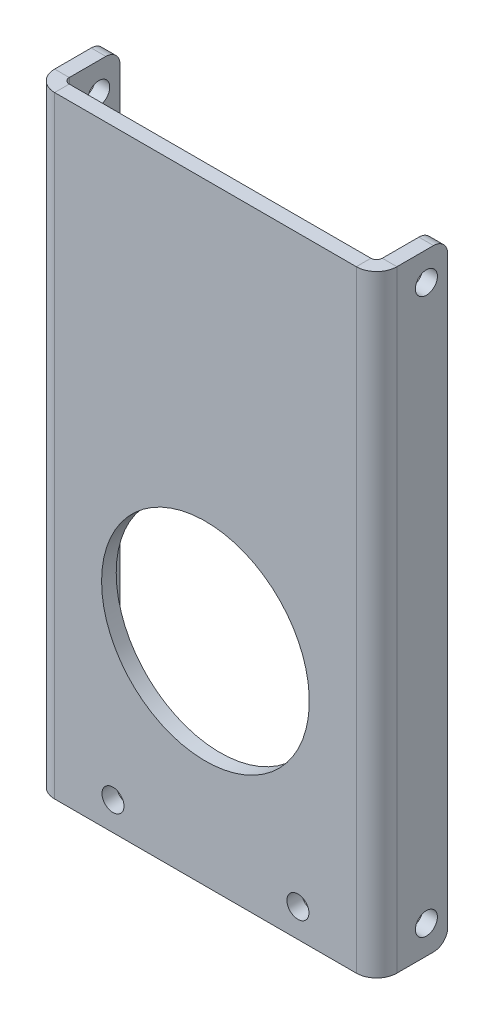
ISO-10303-21;
HEADER;
FILE_DESCRIPTION(('STEP AP214'),'2;1');
FILE_NAME('part.step','',(''),(''),'','','');
FILE_SCHEMA(('AUTOMOTIVE_DESIGN { 1 0 10303 214 1 1 1 1 }'));
ENDSEC;
DATA;
#1=APPLICATION_CONTEXT('core data for automotive mechanical design processes');
#2=APPLICATION_PROTOCOL_DEFINITION('international standard','automotive_design',2000,#1);
#3=PRODUCT_CONTEXT('',#1,'mechanical');
#4=PRODUCT('Part','Part','',(#3));
#5=PRODUCT_RELATED_PRODUCT_CATEGORY('part','',(#4));
#6=PRODUCT_DEFINITION_FORMATION('','',#4);
#7=PRODUCT_DEFINITION_CONTEXT('part definition',#1,'design');
#8=PRODUCT_DEFINITION('design','',#6,#7);
#9=PRODUCT_DEFINITION_SHAPE('','',#8);
#10=(LENGTH_UNIT() NAMED_UNIT(*) SI_UNIT(.MILLI.,.METRE.));
#11=(NAMED_UNIT(*) PLANE_ANGLE_UNIT() SI_UNIT($,.RADIAN.));
#12=(NAMED_UNIT(*) SI_UNIT($,.STERADIAN.) SOLID_ANGLE_UNIT());
#13=UNCERTAINTY_MEASURE_WITH_UNIT(LENGTH_MEASURE(1.E-05),#10,'distance_accuracy_value','');
#14=(GEOMETRIC_REPRESENTATION_CONTEXT(3) GLOBAL_UNCERTAINTY_ASSIGNED_CONTEXT((#13)) GLOBAL_UNIT_ASSIGNED_CONTEXT((#10,
#11,#12)) REPRESENTATION_CONTEXT('',''));
#15=CARTESIAN_POINT('',(0.,0.,0.));
#16=DIRECTION('',(0.,0.,1.));
#17=DIRECTION('',(1.,0.,0.));
#18=AXIS2_PLACEMENT_3D('',#15,#16,#17);
#19=CARTESIAN_POINT('',(0.,0.,-3.26389999999999));
#20=DIRECTION('',(0.,0.,1.));
#21=DIRECTION('',(1.,0.,0.));
#22=AXIS2_PLACEMENT_3D('',#19,#20,#21);
#23=PLANE('',#22);
#24=CARTESIAN_POINT('',(-20.6375,-40.978582,-3.26389999999999));
#25=DIRECTION('',(0.,0.,1.));
#26=DIRECTION('',(1.,0.,0.));
#27=AXIS2_PLACEMENT_3D('',#24,#25,#26);
#28=CIRCLE('',#27,2.45744999999999);
#29=CARTESIAN_POINT('',(-18.18005,-40.978582,-3.26389999999999));
#30=VERTEX_POINT('',#29);
#31=EDGE_CURVE('E526',#30,#30,#28,.T.);
#32=ORIENTED_EDGE('',*,*,#31,.T.);
#33=EDGE_LOOP('',(#32));
#34=FACE_BOUND('',#33,.T.);
#35=CARTESIAN_POINT('',(20.6375,-40.978582,-3.26389999999999));
#36=DIRECTION('',(0.,0.,1.));
#37=DIRECTION('',(1.,0.,0.));
#38=AXIS2_PLACEMENT_3D('',#35,#36,#37);
#39=CIRCLE('',#38,2.45744999999999);
#40=CARTESIAN_POINT('',(23.09495,-40.978582,-3.26389999999999));
#41=VERTEX_POINT('',#40);
#42=EDGE_CURVE('E536',#41,#41,#39,.T.);
#43=ORIENTED_EDGE('',*,*,#42,.T.);
#44=EDGE_LOOP('',(#43));
#45=FACE_BOUND('',#44,.T.);
#46=CARTESIAN_POINT('',(0.,0.,-3.26389999999999));
#47=DIRECTION('',(0.,0.,-1.));
#48=DIRECTION('',(-1.,0.,0.));
#49=AXIS2_PLACEMENT_3D('',#46,#47,#48);
#50=CIRCLE('',#49,23.1775);
#51=CARTESIAN_POINT('',(-23.1775,0.,-3.26389999999999));
#52=VERTEX_POINT('',#51);
#53=EDGE_CURVE('E539',#52,#52,#50,.T.);
#54=ORIENTED_EDGE('',*,*,#53,.F.);
#55=EDGE_LOOP('',(#54));
#56=FACE_BOUND('',#55,.T.);
#57=DIRECTION('',(0.,1.,0.));
#58=VECTOR('',#57,1.);
#59=CARTESIAN_POINT('',(-33.655,89.196418,-3.26389999999999));
#60=LINE('',#59,#58);
#61=CARTESIAN_POINT('',(-33.655,89.196418,-3.26389999999999));
#62=VERTEX_POINT('',#61);
#63=CARTESIAN_POINT('',(-33.655,-47.328582,-3.26389999999999));
#64=VERTEX_POINT('',#63);
#65=EDGE_CURVE('E264',#62,#64,#60,.F.);
#66=ORIENTED_EDGE('',*,*,#65,.F.);
#67=DIRECTION('',(-1.,0.,0.));
#68=VECTOR('',#67,1.);
#69=CARTESIAN_POINT('',(-38.1889,89.196418,-3.26389999999999));
#70=LINE('',#69,#68);
#71=CARTESIAN_POINT('',(33.655,89.196418,-3.26389999999999));
#72=VERTEX_POINT('',#71);
#73=EDGE_CURVE('E325',#72,#62,#70,.T.);
#74=ORIENTED_EDGE('',*,*,#73,.F.);
#75=DIRECTION('',(0.,-1.,0.));
#76=VECTOR('',#75,1.);
#77=CARTESIAN_POINT('',(33.655,-47.328582,-3.26390000000001));
#78=LINE('',#77,#76);
#79=CARTESIAN_POINT('',(33.655,-47.3285819999999,-3.26390000000001));
#80=VERTEX_POINT('',#79);
#81=EDGE_CURVE('E312',#80,#72,#78,.F.);
#82=ORIENTED_EDGE('',*,*,#81,.F.);
#83=DIRECTION('',(1.,0.,0.));
#84=VECTOR('',#83,1.);
#85=CARTESIAN_POINT('',(-38.1889,-47.328582,-3.26390000000001));
#86=LINE('',#85,#84);
#87=EDGE_CURVE('E322',#64,#80,#86,.T.);
#88=ORIENTED_EDGE('',*,*,#87,.F.);
#89=EDGE_LOOP('',(#66,#74,#82,#88));
#90=FACE_BOUND('',#89,.T.);
#91=ADVANCED_FACE('F97',(#34,#45,#56,#90),#23,.F.);
#92=CARTESIAN_POINT('',(0.,0.,0.));
#93=DIRECTION('',(0.,0.,1.));
#94=DIRECTION('',(1.,0.,0.));
#95=AXIS2_PLACEMENT_3D('',#92,#93,#94);
#96=PLANE('',#95);
#97=CARTESIAN_POINT('',(-20.6375,-40.978582,0.));
#98=DIRECTION('',(0.,0.,1.));
#99=DIRECTION('',(1.,0.,0.));
#100=AXIS2_PLACEMENT_3D('',#97,#98,#99);
#101=CIRCLE('',#100,2.45744999999999);
#102=CARTESIAN_POINT('',(-18.18005,-40.978582,0.));
#103=VERTEX_POINT('',#102);
#104=EDGE_CURVE('E529',#103,#103,#101,.T.);
#105=ORIENTED_EDGE('',*,*,#104,.F.);
#106=EDGE_LOOP('',(#105));
#107=FACE_BOUND('',#106,.T.);
#108=CARTESIAN_POINT('',(20.6375,-40.978582,0.));
#109=DIRECTION('',(0.,0.,1.));
#110=DIRECTION('',(1.,0.,0.));
#111=AXIS2_PLACEMENT_3D('',#108,#109,#110);
#112=CIRCLE('',#111,2.45744999999999);
#113=CARTESIAN_POINT('',(23.09495,-40.978582,0.));
#114=VERTEX_POINT('',#113);
#115=EDGE_CURVE('E531',#114,#114,#112,.T.);
#116=ORIENTED_EDGE('',*,*,#115,.F.);
#117=EDGE_LOOP('',(#116));
#118=FACE_BOUND('',#117,.T.);
#119=CARTESIAN_POINT('',(0.,0.,0.));
#120=DIRECTION('',(0.,0.,-1.));
#121=DIRECTION('',(-1.,0.,0.));
#122=AXIS2_PLACEMENT_3D('',#119,#120,#121);
#123=CIRCLE('',#122,23.1775);
#124=CARTESIAN_POINT('',(-23.1775,0.,0.));
#125=VERTEX_POINT('',#124);
#126=EDGE_CURVE('E540',#125,#125,#123,.T.);
#127=ORIENTED_EDGE('',*,*,#126,.T.);
#128=EDGE_LOOP('',(#127));
#129=FACE_BOUND('',#128,.T.);
#130=DIRECTION('',(-1.,0.,0.));
#131=VECTOR('',#130,1.);
#132=CARTESIAN_POINT('',(-38.1889,89.196418,0.));
#133=LINE('',#132,#131);
#134=CARTESIAN_POINT('',(33.655,89.196418,0.));
#135=VERTEX_POINT('',#134);
#136=CARTESIAN_POINT('',(-33.655,89.196418,0.));
#137=VERTEX_POINT('',#136);
#138=EDGE_CURVE('E326',#135,#137,#133,.T.);
#139=ORIENTED_EDGE('',*,*,#138,.T.);
#140=DIRECTION('',(0.,1.,0.));
#141=VECTOR('',#140,1.);
#142=CARTESIAN_POINT('',(-33.655,89.196418,0.));
#143=LINE('',#142,#141);
#144=CARTESIAN_POINT('',(-33.655,-47.328582,0.));
#145=VERTEX_POINT('',#144);
#146=EDGE_CURVE('E231',#137,#145,#143,.F.);
#147=ORIENTED_EDGE('',*,*,#146,.T.);
#148=DIRECTION('',(1.,0.,0.));
#149=VECTOR('',#148,1.);
#150=CARTESIAN_POINT('',(-38.1889,-47.328582,0.));
#151=LINE('',#150,#149);
#152=CARTESIAN_POINT('',(33.655,-47.3285819999999,0.));
#153=VERTEX_POINT('',#152);
#154=EDGE_CURVE('E319',#145,#153,#151,.T.);
#155=ORIENTED_EDGE('',*,*,#154,.T.);
#156=DIRECTION('',(0.,-1.,0.));
#157=VECTOR('',#156,1.);
#158=CARTESIAN_POINT('',(33.655,-47.328582,0.));
#159=LINE('',#158,#157);
#160=EDGE_CURVE('E299',#153,#135,#159,.F.);
#161=ORIENTED_EDGE('',*,*,#160,.T.);
#162=EDGE_LOOP('',(#139,#147,#155,#161));
#163=FACE_BOUND('',#162,.T.);
#164=ADVANCED_FACE('F405',(#107,#118,#129,#163),#96,.T.);
#165=CARTESIAN_POINT('',(-38.1889,89.196418,-3.26389999999999));
#166=DIRECTION('',(0.,0.999999999999999,0.));
#167=DIRECTION('',(-1.,0.,0.));
#168=AXIS2_PLACEMENT_3D('',#165,#166,#167);
#169=PLANE('',#168);
#170=ORIENTED_EDGE('',*,*,#73,.T.);
#171=DIRECTION('',(0.,0.,1.));
#172=VECTOR('',#171,1.);
#173=CARTESIAN_POINT('',(-33.655,89.196418,-3.26389999999999));
#174=LINE('',#173,#172);
#175=EDGE_CURVE('E260',#62,#137,#174,.T.);
#176=ORIENTED_EDGE('',*,*,#175,.T.);
#177=ORIENTED_EDGE('',*,*,#138,.F.);
#178=DIRECTION('',(0.,0.,1.));
#179=VECTOR('',#178,1.);
#180=CARTESIAN_POINT('',(33.655,89.196418,-3.26389999999999));
#181=LINE('',#180,#179);
#182=EDGE_CURVE('E316',#72,#135,#181,.T.);
#183=ORIENTED_EDGE('',*,*,#182,.F.);
#184=EDGE_LOOP('',(#170,#176,#177,#183));
#185=FACE_BOUND('',#184,.T.);
#186=ADVANCED_FACE('F403',(#185),#169,.T.);
#187=CARTESIAN_POINT('',(-38.1889,-47.328582,-3.26390000000001));
#188=DIRECTION('',(0.,-0.999999999999999,0.));
#189=DIRECTION('',(1.,0.,0.));
#190=AXIS2_PLACEMENT_3D('',#187,#188,#189);
#191=PLANE('',#190);
#192=DIRECTION('',(0.,0.,1.));
#193=VECTOR('',#192,1.);
#194=CARTESIAN_POINT('',(-33.655,-47.328582,-3.26389999999999));
#195=LINE('',#194,#193);
#196=EDGE_CURVE('E267',#64,#145,#195,.T.);
#197=ORIENTED_EDGE('',*,*,#196,.F.);
#198=ORIENTED_EDGE('',*,*,#87,.T.);
#199=DIRECTION('',(0.,0.,1.));
#200=VECTOR('',#199,1.);
#201=CARTESIAN_POINT('',(33.655,-47.3285819999999,-3.26390000000001));
#202=LINE('',#201,#200);
#203=EDGE_CURVE('E306',#80,#153,#202,.T.);
#204=ORIENTED_EDGE('',*,*,#203,.T.);
#205=ORIENTED_EDGE('',*,*,#154,.F.);
#206=EDGE_LOOP('',(#197,#198,#204,#205));
#207=FACE_BOUND('',#206,.T.);
#208=ADVANCED_FACE('F389',(#207),#191,.T.);
#209=CARTESIAN_POINT('',(33.655,89.196418,-4.53389999999995));
#210=DIRECTION('',(0.,1.,0.));
#211=DIRECTION('',(0.,0.,1.));
#212=AXIS2_PLACEMENT_3D('',#209,#210,#211);
#213=PLANE('',#212);
#214=DIRECTION('',(1.,0.,0.));
#215=VECTOR('',#214,1.);
#216=CARTESIAN_POINT('',(38.1889,89.196418,-4.53389999999995));
#217=LINE('',#216,#215);
#218=CARTESIAN_POINT('',(34.925,89.196418,-4.53389999999995));
#219=VERTEX_POINT('',#218);
#220=CARTESIAN_POINT('',(38.1889,89.196418,-4.53389999999995));
#221=VERTEX_POINT('',#220);
#222=EDGE_CURVE('E270',#219,#221,#217,.T.);
#223=ORIENTED_EDGE('',*,*,#222,.F.);
#224=CARTESIAN_POINT('',(33.655,89.196418,-4.53389999999995));
#225=DIRECTION('',(0.,-1.,0.));
#226=DIRECTION('',(0.,0.,-1.));
#227=AXIS2_PLACEMENT_3D('',#224,#225,#226);
#228=CIRCLE('',#227,1.26999999999999);
#229=EDGE_CURVE('E309',#72,#219,#228,.F.);
#230=ORIENTED_EDGE('',*,*,#229,.F.);
#231=ORIENTED_EDGE('',*,*,#182,.T.);
#232=CARTESIAN_POINT('',(33.655,89.196418,-4.53389999999995));
#233=DIRECTION('',(0.,-1.,0.));
#234=DIRECTION('',(0.,0.,-1.));
#235=AXIS2_PLACEMENT_3D('',#232,#233,#234);
#236=CIRCLE('',#235,4.53389999999999);
#237=EDGE_CURVE('E302',#135,#221,#236,.F.);
#238=ORIENTED_EDGE('',*,*,#237,.T.);
#239=EDGE_LOOP('',(#223,#230,#231,#238));
#240=FACE_BOUND('',#239,.T.);
#241=ADVANCED_FACE('F400',(#240),#213,.T.);
#242=CARTESIAN_POINT('',(33.655,-47.3285819999999,-4.53389999999995));
#243=DIRECTION('',(0.,1.,0.));
#244=DIRECTION('',(0.,0.,1.));
#245=AXIS2_PLACEMENT_3D('',#242,#243,#244);
#246=PLANE('',#245);
#247=CARTESIAN_POINT('',(33.655,-47.3285819999999,-4.53389999999995));
#248=DIRECTION('',(0.,-1.,0.));
#249=DIRECTION('',(0.,0.,-1.));
#250=AXIS2_PLACEMENT_3D('',#247,#248,#249);
#251=CIRCLE('',#250,1.26999999999999);
#252=CARTESIAN_POINT('',(34.925,-47.3285819999999,-4.53389999999995));
#253=VERTEX_POINT('',#252);
#254=EDGE_CURVE('E274',#253,#80,#251,.T.);
#255=ORIENTED_EDGE('',*,*,#254,.F.);
#256=DIRECTION('',(1.,0.,0.));
#257=VECTOR('',#256,1.);
#258=CARTESIAN_POINT('',(34.925,-47.3285819999999,-4.53389999999998));
#259=LINE('',#258,#257);
#260=CARTESIAN_POINT('',(38.1889,-47.3285819999999,-4.53389999999995));
#261=VERTEX_POINT('',#260);
#262=EDGE_CURVE('E291',#253,#261,#259,.T.);
#263=ORIENTED_EDGE('',*,*,#262,.T.);
#264=CARTESIAN_POINT('',(33.655,-47.3285819999999,-4.53389999999995));
#265=DIRECTION('',(0.,-1.,0.));
#266=DIRECTION('',(0.,0.,-1.));
#267=AXIS2_PLACEMENT_3D('',#264,#265,#266);
#268=CIRCLE('',#267,4.53389999999999);
#269=EDGE_CURVE('E303',#261,#153,#268,.T.);
#270=ORIENTED_EDGE('',*,*,#269,.T.);
#271=ORIENTED_EDGE('',*,*,#203,.F.);
#272=EDGE_LOOP('',(#255,#263,#270,#271));
#273=FACE_BOUND('',#272,.T.);
#274=ADVANCED_FACE('F410',(#273),#246,.F.);
#275=CARTESIAN_POINT('',(33.655,-47.328582,-4.53389999999995));
#276=DIRECTION('',(0.,-1.,0.));
#277=DIRECTION('',(1.,0.,0.));
#278=AXIS2_PLACEMENT_3D('',#275,#276,#277);
#279=CYLINDRICAL_SURFACE('',#278,4.53389999999999);
#280=ORIENTED_EDGE('',*,*,#160,.F.);
#281=ORIENTED_EDGE('',*,*,#269,.F.);
#282=DIRECTION('',(0.,-1.,0.));
#283=VECTOR('',#282,1.);
#284=CARTESIAN_POINT('',(38.1889,0.,-4.53389999999995));
#285=LINE('',#284,#283);
#286=EDGE_CURVE('E288',#221,#261,#285,.T.);
#287=ORIENTED_EDGE('',*,*,#286,.F.);
#288=ORIENTED_EDGE('',*,*,#237,.F.);
#289=EDGE_LOOP('',(#280,#281,#287,#288));
#290=FACE_BOUND('',#289,.T.);
#291=ADVANCED_FACE('F408',(#290),#279,.T.);
#292=CARTESIAN_POINT('',(33.655,-47.328582,-4.53389999999995));
#293=DIRECTION('',(0.,-1.,0.));
#294=DIRECTION('',(1.,0.,0.));
#295=AXIS2_PLACEMENT_3D('',#292,#293,#294);
#296=CYLINDRICAL_SURFACE('',#295,1.26999999999999);
#297=ORIENTED_EDGE('',*,*,#81,.T.);
#298=ORIENTED_EDGE('',*,*,#229,.T.);
#299=DIRECTION('',(0.,1.,0.));
#300=VECTOR('',#299,1.);
#301=CARTESIAN_POINT('',(34.925,89.196418,-4.53389999999995));
#302=LINE('',#301,#300);
#303=EDGE_CURVE('E294',#219,#253,#302,.F.);
#304=ORIENTED_EDGE('',*,*,#303,.T.);
#305=ORIENTED_EDGE('',*,*,#254,.T.);
#306=EDGE_LOOP('',(#297,#298,#304,#305));
#307=FACE_BOUND('',#306,.T.);
#308=ADVANCED_FACE('F395',(#307),#296,.F.);
#309=CARTESIAN_POINT('',(38.1889,-47.328582,-3.26389999999996));
#310=DIRECTION('',(0.,-0.999999999999999,0.));
#311=DIRECTION('',(1.,0.,0.));
#312=AXIS2_PLACEMENT_3D('',#309,#310,#311);
#313=PLANE('',#312);
#314=DIRECTION('',(0.,0.,-1.));
#315=VECTOR('',#314,1.);
#316=CARTESIAN_POINT('',(34.925,-47.328582,1.38777878078144E-13));
#317=LINE('',#316,#315);
#318=CARTESIAN_POINT('',(34.925,-47.3285819999999,-12.7));
#319=VERTEX_POINT('',#318);
#320=EDGE_CURVE('E280',#319,#253,#317,.F.);
#321=ORIENTED_EDGE('',*,*,#320,.F.);
#322=DIRECTION('',(-1.,0.,0.));
#323=VECTOR('',#322,1.);
#324=CARTESIAN_POINT('',(38.1889,-47.328582,-12.6999999999999));
#325=LINE('',#324,#323);
#326=CARTESIAN_POINT('',(38.1889,-47.328582,-12.6999999999999));
#327=VERTEX_POINT('',#326);
#328=EDGE_CURVE('E15',#319,#327,#325,.F.);
#329=ORIENTED_EDGE('',*,*,#328,.T.);
#330=DIRECTION('',(0.,0.,1.));
#331=VECTOR('',#330,1.);
#332=CARTESIAN_POINT('',(38.1889,-47.328582,-3.26389999999996));
#333=LINE('',#332,#331);
#334=EDGE_CURVE('E272',#327,#261,#333,.T.);
#335=ORIENTED_EDGE('',*,*,#334,.T.);
#336=ORIENTED_EDGE('',*,*,#262,.F.);
#337=EDGE_LOOP('',(#321,#329,#335,#336));
#338=FACE_BOUND('',#337,.T.);
#339=ADVANCED_FACE('F421',(#338),#313,.T.);
#340=CARTESIAN_POINT('',(38.1889,89.196418,-15.8749999999999));
#341=DIRECTION('',(0.,0.999999999999999,0.));
#342=DIRECTION('',(-1.,0.,0.));
#343=AXIS2_PLACEMENT_3D('',#340,#341,#342);
#344=PLANE('',#343);
#345=DIRECTION('',(0.,0.,-1.));
#346=VECTOR('',#345,1.);
#347=CARTESIAN_POINT('',(38.1889,89.196418,-15.8749999999999));
#348=LINE('',#347,#346);
#349=CARTESIAN_POINT('',(38.1889,89.196418,-12.7));
#350=VERTEX_POINT('',#349);
#351=EDGE_CURVE('E277',#221,#350,#348,.T.);
#352=ORIENTED_EDGE('',*,*,#351,.T.);
#353=DIRECTION('',(-1.,0.,0.));
#354=VECTOR('',#353,1.);
#355=CARTESIAN_POINT('',(38.1889,89.196418,-12.7));
#356=LINE('',#355,#354);
#357=CARTESIAN_POINT('',(34.925,89.196418,-12.7));
#358=VERTEX_POINT('',#357);
#359=EDGE_CURVE('E352',#350,#358,#356,.T.);
#360=ORIENTED_EDGE('',*,*,#359,.T.);
#361=DIRECTION('',(0.,0.,1.));
#362=VECTOR('',#361,1.);
#363=CARTESIAN_POINT('',(34.925,89.196418,1.66533453693774E-13));
#364=LINE('',#363,#362);
#365=EDGE_CURVE('E285',#219,#358,#364,.F.);
#366=ORIENTED_EDGE('',*,*,#365,.F.);
#367=ORIENTED_EDGE('',*,*,#222,.T.);
#368=EDGE_LOOP('',(#352,#360,#366,#367));
#369=FACE_BOUND('',#368,.T.);
#370=ADVANCED_FACE('F416',(#369),#344,.T.);
#371=CARTESIAN_POINT('',(38.1889,0.,1.66533453693773E-13));
#372=DIRECTION('',(1.,0.,0.));
#373=DIRECTION('',(0.,0.,-1.));
#374=AXIS2_PLACEMENT_3D('',#371,#372,#373);
#375=PLANE('',#374);
#376=CARTESIAN_POINT('',(38.1889,82.846418,-11.1125));
#377=DIRECTION('',(1.,0.,0.));
#378=DIRECTION('',(0.,0.,-1.));
#379=AXIS2_PLACEMENT_3D('',#376,#377,#378);
#380=CIRCLE('',#379,2.45745);
#381=CARTESIAN_POINT('',(38.1889,82.846418,-13.56995));
#382=VERTEX_POINT('',#381);
#383=EDGE_CURVE('E543',#382,#382,#380,.T.);
#384=ORIENTED_EDGE('',*,*,#383,.F.);
#385=EDGE_LOOP('',(#384));
#386=FACE_BOUND('',#385,.T.);
#387=CARTESIAN_POINT('',(38.1889,-40.978582,-11.1125));
#388=DIRECTION('',(1.,0.,0.));
#389=DIRECTION('',(0.,0.,-1.));
#390=AXIS2_PLACEMENT_3D('',#387,#388,#389);
#391=CIRCLE('',#390,2.45745);
#392=CARTESIAN_POINT('',(38.1889,-40.978582,-13.56995));
#393=VERTEX_POINT('',#392);
#394=EDGE_CURVE('E552',#393,#393,#391,.T.);
#395=ORIENTED_EDGE('',*,*,#394,.F.);
#396=EDGE_LOOP('',(#395));
#397=FACE_BOUND('',#396,.T.);
#398=DIRECTION('',(0.,-1.,0.));
#399=VECTOR('',#398,1.);
#400=CARTESIAN_POINT('',(38.1889,-47.328582,-15.8749999999999));
#401=LINE('',#400,#399);
#402=CARTESIAN_POINT('',(38.1889,86.021418,-15.8749999999999));
#403=VERTEX_POINT('',#402);
#404=CARTESIAN_POINT('',(38.1889000000001,-44.153582,-15.8749999999999));
#405=VERTEX_POINT('',#404);
#406=EDGE_CURVE('E275',#403,#405,#401,.T.);
#407=ORIENTED_EDGE('',*,*,#406,.F.);
#408=CARTESIAN_POINT('',(38.1889,86.021418,-12.7));
#409=DIRECTION('',(1.,0.,0.));
#410=DIRECTION('',(0.,0.,-1.));
#411=AXIS2_PLACEMENT_3D('',#408,#409,#410);
#412=CIRCLE('',#411,3.175);
#413=EDGE_CURVE('E365',#403,#350,#412,.T.);
#414=ORIENTED_EDGE('',*,*,#413,.T.);
#415=ORIENTED_EDGE('',*,*,#351,.F.);
#416=ORIENTED_EDGE('',*,*,#286,.T.);
#417=ORIENTED_EDGE('',*,*,#334,.F.);
#418=CARTESIAN_POINT('',(38.1889,-44.153582,-12.6999999999999));
#419=DIRECTION('',(1.,0.,0.));
#420=DIRECTION('',(0.,0.,-1.));
#421=AXIS2_PLACEMENT_3D('',#418,#419,#420);
#422=CIRCLE('',#421,3.175);
#423=EDGE_CURVE('E117',#327,#405,#422,.T.);
#424=ORIENTED_EDGE('',*,*,#423,.T.);
#425=EDGE_LOOP('',(#407,#414,#415,#416,#417,#424));
#426=FACE_BOUND('',#425,.T.);
#427=ADVANCED_FACE('F413',(#386,#397,#426),#375,.T.);
#428=CARTESIAN_POINT('',(34.925,0.,1.38777878078145E-13));
#429=DIRECTION('',(1.,0.,0.));
#430=DIRECTION('',(0.,0.,-1.));
#431=AXIS2_PLACEMENT_3D('',#428,#429,#430);
#432=PLANE('',#431);
#433=CARTESIAN_POINT('',(34.925,82.846418,-11.1125));
#434=DIRECTION('',(1.,0.,0.));
#435=DIRECTION('',(0.,0.,-1.));
#436=AXIS2_PLACEMENT_3D('',#433,#434,#435);
#437=CIRCLE('',#436,2.45744999999999);
#438=CARTESIAN_POINT('',(34.925,82.846418,-13.56995));
#439=VERTEX_POINT('',#438);
#440=EDGE_CURVE('E337',#439,#439,#437,.T.);
#441=ORIENTED_EDGE('',*,*,#440,.T.);
#442=EDGE_LOOP('',(#441));
#443=FACE_BOUND('',#442,.T.);
#444=CARTESIAN_POINT('',(34.925,-40.978582,-11.1125));
#445=DIRECTION('',(1.,0.,0.));
#446=DIRECTION('',(0.,0.,-1.));
#447=AXIS2_PLACEMENT_3D('',#444,#445,#446);
#448=CIRCLE('',#447,2.45744999999999);
#449=CARTESIAN_POINT('',(34.925,-40.978582,-13.56995));
#450=VERTEX_POINT('',#449);
#451=EDGE_CURVE('E257',#450,#450,#448,.T.);
#452=ORIENTED_EDGE('',*,*,#451,.T.);
#453=EDGE_LOOP('',(#452));
#454=FACE_BOUND('',#453,.T.);
#455=ORIENTED_EDGE('',*,*,#365,.T.);
#456=CARTESIAN_POINT('',(34.925,86.021418,-12.7));
#457=DIRECTION('',(1.,0.,0.));
#458=DIRECTION('',(0.,0.,-1.));
#459=AXIS2_PLACEMENT_3D('',#456,#457,#458);
#460=CIRCLE('',#459,3.175);
#461=CARTESIAN_POINT('',(34.925,86.021418,-15.8749999999999));
#462=VERTEX_POINT('',#461);
#463=EDGE_CURVE('E357',#358,#462,#460,.F.);
#464=ORIENTED_EDGE('',*,*,#463,.T.);
#465=DIRECTION('',(0.,1.,0.));
#466=VECTOR('',#465,1.);
#467=CARTESIAN_POINT('',(34.925,0.,-15.875));
#468=LINE('',#467,#466);
#469=CARTESIAN_POINT('',(34.9250000000001,-44.153582,-15.875));
#470=VERTEX_POINT('',#469);
#471=EDGE_CURVE('E282',#462,#470,#468,.F.);
#472=ORIENTED_EDGE('',*,*,#471,.T.);
#473=CARTESIAN_POINT('',(34.925,-44.153582,-12.7));
#474=DIRECTION('',(1.,0.,0.));
#475=DIRECTION('',(0.,0.,-1.));
#476=AXIS2_PLACEMENT_3D('',#473,#474,#475);
#477=CIRCLE('',#476,3.175);
#478=EDGE_CURVE('E355',#470,#319,#477,.F.);
#479=ORIENTED_EDGE('',*,*,#478,.T.);
#480=ORIENTED_EDGE('',*,*,#320,.T.);
#481=ORIENTED_EDGE('',*,*,#303,.F.);
#482=EDGE_LOOP('',(#455,#464,#472,#479,#480,#481));
#483=FACE_BOUND('',#482,.T.);
#484=ADVANCED_FACE('F419',(#443,#454,#483),#432,.F.);
#485=CARTESIAN_POINT('',(38.1889,-47.328582,-15.8749999999999));
#486=DIRECTION('',(0.,0.,-0.999999999999999));
#487=DIRECTION('',(-1.,0.,0.));
#488=AXIS2_PLACEMENT_3D('',#485,#486,#487);
#489=PLANE('',#488);
#490=ORIENTED_EDGE('',*,*,#471,.F.);
#491=DIRECTION('',(-1.,0.,0.));
#492=VECTOR('',#491,1.);
#493=CARTESIAN_POINT('',(38.1889,86.021418,-15.8749999999999));
#494=LINE('',#493,#492);
#495=EDGE_CURVE('E362',#462,#403,#494,.F.);
#496=ORIENTED_EDGE('',*,*,#495,.T.);
#497=ORIENTED_EDGE('',*,*,#406,.T.);
#498=DIRECTION('',(-1.,0.,0.));
#499=VECTOR('',#498,1.);
#500=CARTESIAN_POINT('',(38.1889000000001,-44.153582,-15.8749999999999));
#501=LINE('',#500,#499);
#502=EDGE_CURVE('E359',#405,#470,#501,.T.);
#503=ORIENTED_EDGE('',*,*,#502,.T.);
#504=EDGE_LOOP('',(#490,#496,#497,#503));
#505=FACE_BOUND('',#504,.T.);
#506=ADVANCED_FACE('F425',(#505),#489,.T.);
#507=CARTESIAN_POINT('',(-33.655,-47.328582,-4.53389999999995));
#508=DIRECTION('',(0.,-1.,0.));
#509=DIRECTION('',(0.,0.,-1.));
#510=AXIS2_PLACEMENT_3D('',#507,#508,#509);
#511=PLANE('',#510);
#512=DIRECTION('',(-1.,0.,0.));
#513=VECTOR('',#512,1.);
#514=CARTESIAN_POINT('',(-38.1889,-47.328582,-4.53389999999995));
#515=LINE('',#514,#513);
#516=CARTESIAN_POINT('',(-34.925,-47.328582,-4.53389999999995));
#517=VERTEX_POINT('',#516);
#518=CARTESIAN_POINT('',(-38.1889,-47.328582,-4.53389999999995));
#519=VERTEX_POINT('',#518);
#520=EDGE_CURVE('E254',#517,#519,#515,.T.);
#521=ORIENTED_EDGE('',*,*,#520,.F.);
#522=CARTESIAN_POINT('',(-33.655,-47.328582,-4.53389999999995));
#523=DIRECTION('',(0.,1.,0.));
#524=DIRECTION('',(0.,0.,1.));
#525=AXIS2_PLACEMENT_3D('',#522,#523,#524);
#526=CIRCLE('',#525,1.26999999999999);
#527=EDGE_CURVE('E234',#64,#517,#526,.F.);
#528=ORIENTED_EDGE('',*,*,#527,.F.);
#529=ORIENTED_EDGE('',*,*,#196,.T.);
#530=CARTESIAN_POINT('',(-33.655,-47.328582,-4.53389999999995));
#531=DIRECTION('',(0.,1.,0.));
#532=DIRECTION('',(0.,0.,1.));
#533=AXIS2_PLACEMENT_3D('',#530,#531,#532);
#534=CIRCLE('',#533,4.53389999999999);
#535=EDGE_CURVE('E259',#145,#519,#534,.F.);
#536=ORIENTED_EDGE('',*,*,#535,.T.);
#537=EDGE_LOOP('',(#521,#528,#529,#536));
#538=FACE_BOUND('',#537,.T.);
#539=ADVANCED_FACE('F385',(#538),#511,.T.);
#540=CARTESIAN_POINT('',(-33.655,89.196418,-4.53389999999995));
#541=DIRECTION('',(0.,-1.,0.));
#542=DIRECTION('',(0.,0.,-1.));
#543=AXIS2_PLACEMENT_3D('',#540,#541,#542);
#544=PLANE('',#543);
#545=CARTESIAN_POINT('',(-33.655,89.196418,-4.53389999999995));
#546=DIRECTION('',(0.,1.,0.));
#547=DIRECTION('',(0.,0.,1.));
#548=AXIS2_PLACEMENT_3D('',#545,#546,#547);
#549=CIRCLE('',#548,1.26999999999999);
#550=CARTESIAN_POINT('',(-34.925,89.196418,-4.53389999999995));
#551=VERTEX_POINT('',#550);
#552=EDGE_CURVE('E221',#551,#62,#549,.T.);
#553=ORIENTED_EDGE('',*,*,#552,.F.);
#554=DIRECTION('',(-1.,0.,0.));
#555=VECTOR('',#554,1.);
#556=CARTESIAN_POINT('',(-34.925,89.196418,-4.53389999999995));
#557=LINE('',#556,#555);
#558=CARTESIAN_POINT('',(-38.1889,89.196418,-4.53389999999995));
#559=VERTEX_POINT('',#558);
#560=EDGE_CURVE('E215',#551,#559,#557,.T.);
#561=ORIENTED_EDGE('',*,*,#560,.T.);
#562=CARTESIAN_POINT('',(-33.655,89.196418,-4.53389999999995));
#563=DIRECTION('',(0.,1.,0.));
#564=DIRECTION('',(0.,0.,1.));
#565=AXIS2_PLACEMENT_3D('',#562,#563,#564);
#566=CIRCLE('',#565,4.53389999999999);
#567=EDGE_CURVE('E226',#559,#137,#566,.T.);
#568=ORIENTED_EDGE('',*,*,#567,.T.);
#569=ORIENTED_EDGE('',*,*,#175,.F.);
#570=EDGE_LOOP('',(#553,#561,#568,#569));
#571=FACE_BOUND('',#570,.T.);
#572=ADVANCED_FACE('F237',(#571),#544,.F.);
#573=CARTESIAN_POINT('',(-33.655,89.196418,-4.53389999999995));
#574=DIRECTION('',(0.,1.,0.));
#575=DIRECTION('',(-1.,0.,0.));
#576=AXIS2_PLACEMENT_3D('',#573,#574,#575);
#577=CYLINDRICAL_SURFACE('',#576,4.53389999999999);
#578=ORIENTED_EDGE('',*,*,#146,.F.);
#579=ORIENTED_EDGE('',*,*,#567,.F.);
#580=DIRECTION('',(0.,1.,0.));
#581=VECTOR('',#580,1.);
#582=CARTESIAN_POINT('',(-38.1889,-47.328582,-4.53389999999995));
#583=LINE('',#582,#581);
#584=EDGE_CURVE('E228',#559,#519,#583,.F.);
#585=ORIENTED_EDGE('',*,*,#584,.T.);
#586=ORIENTED_EDGE('',*,*,#535,.F.);
#587=EDGE_LOOP('',(#578,#579,#585,#586));
#588=FACE_BOUND('',#587,.T.);
#589=ADVANCED_FACE('F227',(#588),#577,.T.);
#590=CARTESIAN_POINT('',(-33.655,89.196418,-4.53389999999995));
#591=DIRECTION('',(0.,1.,0.));
#592=DIRECTION('',(-1.,0.,0.));
#593=AXIS2_PLACEMENT_3D('',#590,#591,#592);
#594=CYLINDRICAL_SURFACE('',#593,1.26999999999999);
#595=ORIENTED_EDGE('',*,*,#65,.T.);
#596=ORIENTED_EDGE('',*,*,#527,.T.);
#597=DIRECTION('',(0.,1.,0.));
#598=VECTOR('',#597,1.);
#599=CARTESIAN_POINT('',(-34.925,-47.328582,-4.53389999999995));
#600=LINE('',#599,#598);
#601=EDGE_CURVE('E239',#517,#551,#600,.T.);
#602=ORIENTED_EDGE('',*,*,#601,.T.);
#603=ORIENTED_EDGE('',*,*,#552,.T.);
#604=EDGE_LOOP('',(#595,#596,#602,#603));
#605=FACE_BOUND('',#604,.T.);
#606=ADVANCED_FACE('F380',(#605),#594,.F.);
#607=CARTESIAN_POINT('',(-38.1889,-47.328582,-3.26389999999999));
#608=DIRECTION('',(0.,-0.999999999999999,0.));
#609=DIRECTION('',(1.,0.,0.));
#610=AXIS2_PLACEMENT_3D('',#607,#608,#609);
#611=PLANE('',#610);
#612=DIRECTION('',(0.,0.,1.));
#613=VECTOR('',#612,1.);
#614=CARTESIAN_POINT('',(-38.1889,-47.328582,-3.26389999999999));
#615=LINE('',#614,#613);
#616=CARTESIAN_POINT('',(-38.1889,-47.328582,-12.7));
#617=VERTEX_POINT('',#616);
#618=EDGE_CURVE('E244',#519,#617,#615,.F.);
#619=ORIENTED_EDGE('',*,*,#618,.T.);
#620=DIRECTION('',(1.,0.,0.));
#621=VECTOR('',#620,1.);
#622=CARTESIAN_POINT('',(-38.1889,-47.328582,-12.7));
#623=LINE('',#622,#621);
#624=CARTESIAN_POINT('',(-34.925,-47.328582,-12.7));
#625=VERTEX_POINT('',#624);
#626=EDGE_CURVE('E105',#617,#625,#623,.T.);
#627=ORIENTED_EDGE('',*,*,#626,.T.);
#628=DIRECTION('',(0.,0.,-1.));
#629=VECTOR('',#628,1.);
#630=CARTESIAN_POINT('',(-34.925,-47.328582,1.66533453693773E-13));
#631=LINE('',#630,#629);
#632=EDGE_CURVE('E245',#517,#625,#631,.T.);
#633=ORIENTED_EDGE('',*,*,#632,.F.);
#634=ORIENTED_EDGE('',*,*,#520,.T.);
#635=EDGE_LOOP('',(#619,#627,#633,#634));
#636=FACE_BOUND('',#635,.T.);
#637=ADVANCED_FACE('F370',(#636),#611,.T.);
#638=CARTESIAN_POINT('',(-38.1889000000001,89.196418,-15.8749999999999));
#639=DIRECTION('',(0.,0.999999999999999,0.));
#640=DIRECTION('',(-1.,0.,0.));
#641=AXIS2_PLACEMENT_3D('',#638,#639,#640);
#642=PLANE('',#641);
#643=DIRECTION('',(0.,0.,1.));
#644=VECTOR('',#643,1.);
#645=CARTESIAN_POINT('',(-34.925,89.196418,1.66533453693774E-13));
#646=LINE('',#645,#644);
#647=CARTESIAN_POINT('',(-34.925,89.196418,-12.6999999999999));
#648=VERTEX_POINT('',#647);
#649=EDGE_CURVE('E378',#648,#551,#646,.T.);
#650=ORIENTED_EDGE('',*,*,#649,.F.);
#651=DIRECTION('',(1.,0.,0.));
#652=VECTOR('',#651,1.);
#653=CARTESIAN_POINT('',(-38.1889,89.196418,-12.6999999999999));
#654=LINE('',#653,#652);
#655=CARTESIAN_POINT('',(-38.1889,89.196418,-12.6999999999999));
#656=VERTEX_POINT('',#655);
#657=EDGE_CURVE('E217',#648,#656,#654,.F.);
#658=ORIENTED_EDGE('',*,*,#657,.T.);
#659=DIRECTION('',(0.,0.,-1.));
#660=VECTOR('',#659,1.);
#661=CARTESIAN_POINT('',(-38.1889000000001,89.196418,-15.8749999999999));
#662=LINE('',#661,#660);
#663=EDGE_CURVE('E210',#656,#559,#662,.F.);
#664=ORIENTED_EDGE('',*,*,#663,.T.);
#665=ORIENTED_EDGE('',*,*,#560,.F.);
#666=EDGE_LOOP('',(#650,#658,#664,#665));
#667=FACE_BOUND('',#666,.T.);
#668=ADVANCED_FACE('F213',(#667),#642,.T.);
#669=CARTESIAN_POINT('',(-38.1889,0.,1.66533453693773E-13));
#670=DIRECTION('',(1.,0.,0.));
#671=DIRECTION('',(0.,0.,-1.));
#672=AXIS2_PLACEMENT_3D('',#669,#670,#671);
#673=PLANE('',#672);
#674=CARTESIAN_POINT('',(-38.1889000000001,82.8464180000001,-11.1125000000002));
#675=DIRECTION('',(1.,0.,0.));
#676=DIRECTION('',(0.,0.,-1.));
#677=AXIS2_PLACEMENT_3D('',#674,#675,#676);
#678=CIRCLE('',#677,2.45744999999999);
#679=CARTESIAN_POINT('',(-38.1889000000001,82.8464180000001,-13.5699500000002));
#680=VERTEX_POINT('',#679);
#681=EDGE_CURVE('E338',#680,#680,#678,.T.);
#682=ORIENTED_EDGE('',*,*,#681,.T.);
#683=EDGE_LOOP('',(#682));
#684=FACE_BOUND('',#683,.T.);
#685=CARTESIAN_POINT('',(-38.1889000000001,-40.978582,-11.1125000000003));
#686=DIRECTION('',(1.,0.,0.));
#687=DIRECTION('',(0.,0.,-1.));
#688=AXIS2_PLACEMENT_3D('',#685,#686,#687);
#689=CIRCLE('',#688,2.45744999999998);
#690=CARTESIAN_POINT('',(-38.1889000000001,-40.978582,-13.5699500000003));
#691=VERTEX_POINT('',#690);
#692=EDGE_CURVE('E555',#691,#691,#689,.T.);
#693=ORIENTED_EDGE('',*,*,#692,.T.);
#694=EDGE_LOOP('',(#693));
#695=FACE_BOUND('',#694,.T.);
#696=ORIENTED_EDGE('',*,*,#663,.F.);
#697=CARTESIAN_POINT('',(-38.1889,86.021418,-12.6999999999999));
#698=DIRECTION('',(1.,0.,0.));
#699=DIRECTION('',(0.,0.,-1.));
#700=AXIS2_PLACEMENT_3D('',#697,#698,#699);
#701=CIRCLE('',#700,3.175);
#702=CARTESIAN_POINT('',(-38.1889000000001,86.021418,-15.8749999999999));
#703=VERTEX_POINT('',#702);
#704=EDGE_CURVE('E350',#656,#703,#701,.F.);
#705=ORIENTED_EDGE('',*,*,#704,.T.);
#706=DIRECTION('',(0.,-1.,0.));
#707=VECTOR('',#706,1.);
#708=CARTESIAN_POINT('',(-38.1889,-47.328582,-15.8749999999999));
#709=LINE('',#708,#707);
#710=CARTESIAN_POINT('',(-38.1889,-44.153582,-15.8749999999999));
#711=VERTEX_POINT('',#710);
#712=EDGE_CURVE('E222',#711,#703,#709,.F.);
#713=ORIENTED_EDGE('',*,*,#712,.F.);
#714=CARTESIAN_POINT('',(-38.1889,-44.153582,-12.7));
#715=DIRECTION('',(1.,0.,0.));
#716=DIRECTION('',(0.,0.,-1.));
#717=AXIS2_PLACEMENT_3D('',#714,#715,#716);
#718=CIRCLE('',#717,3.175);
#719=EDGE_CURVE('E348',#711,#617,#718,.F.);
#720=ORIENTED_EDGE('',*,*,#719,.T.);
#721=ORIENTED_EDGE('',*,*,#618,.F.);
#722=ORIENTED_EDGE('',*,*,#584,.F.);
#723=EDGE_LOOP('',(#696,#705,#713,#720,#721,#722));
#724=FACE_BOUND('',#723,.T.);
#725=ADVANCED_FACE('F242',(#684,#695,#724),#673,.F.);
#726=CARTESIAN_POINT('',(-34.925,0.,1.38777878078145E-13));
#727=DIRECTION('',(1.,0.,0.));
#728=DIRECTION('',(0.,0.,-1.));
#729=AXIS2_PLACEMENT_3D('',#726,#727,#728);
#730=PLANE('',#729);
#731=CARTESIAN_POINT('',(-34.9250000000001,82.8464180000001,-11.1125000000002));
#732=DIRECTION('',(1.,0.,0.));
#733=DIRECTION('',(0.,0.,-1.));
#734=AXIS2_PLACEMENT_3D('',#731,#732,#733);
#735=CIRCLE('',#734,2.45744999999999);
#736=CARTESIAN_POINT('',(-34.9250000000001,82.8464180000001,-13.5699500000002));
#737=VERTEX_POINT('',#736);
#738=EDGE_CURVE('E334',#737,#737,#735,.T.);
#739=ORIENTED_EDGE('',*,*,#738,.F.);
#740=EDGE_LOOP('',(#739));
#741=FACE_BOUND('',#740,.T.);
#742=CARTESIAN_POINT('',(-34.925,-40.978582,-11.1125000000002));
#743=DIRECTION('',(1.,0.,0.));
#744=DIRECTION('',(0.,0.,-1.));
#745=AXIS2_PLACEMENT_3D('',#742,#743,#744);
#746=CIRCLE('',#745,2.45744999999999);
#747=CARTESIAN_POINT('',(-34.925,-40.978582,-13.5699500000002));
#748=VERTEX_POINT('',#747);
#749=EDGE_CURVE('E558',#748,#748,#746,.T.);
#750=ORIENTED_EDGE('',*,*,#749,.F.);
#751=EDGE_LOOP('',(#750));
#752=FACE_BOUND('',#751,.T.);
#753=DIRECTION('',(0.,1.,0.));
#754=VECTOR('',#753,1.);
#755=CARTESIAN_POINT('',(-34.9250000000001,0.,-15.8749999999999));
#756=LINE('',#755,#754);
#757=CARTESIAN_POINT('',(-34.925,-44.153582,-15.8749999999999));
#758=VERTEX_POINT('',#757);
#759=CARTESIAN_POINT('',(-34.9250000000001,86.021418,-15.8749999999999));
#760=VERTEX_POINT('',#759);
#761=EDGE_CURVE('E248',#758,#760,#756,.T.);
#762=ORIENTED_EDGE('',*,*,#761,.T.);
#763=CARTESIAN_POINT('',(-34.925,86.021418,-12.6999999999999));
#764=DIRECTION('',(1.,0.,0.));
#765=DIRECTION('',(0.,0.,-1.));
#766=AXIS2_PLACEMENT_3D('',#763,#764,#765);
#767=CIRCLE('',#766,3.175);
#768=EDGE_CURVE('E345',#760,#648,#767,.T.);
#769=ORIENTED_EDGE('',*,*,#768,.T.);
#770=ORIENTED_EDGE('',*,*,#649,.T.);
#771=ORIENTED_EDGE('',*,*,#601,.F.);
#772=ORIENTED_EDGE('',*,*,#632,.T.);
#773=CARTESIAN_POINT('',(-34.925,-44.153582,-12.7));
#774=DIRECTION('',(1.,0.,0.));
#775=DIRECTION('',(0.,0.,-1.));
#776=AXIS2_PLACEMENT_3D('',#773,#774,#775);
#777=CIRCLE('',#776,3.175);
#778=EDGE_CURVE('E343',#625,#758,#777,.T.);
#779=ORIENTED_EDGE('',*,*,#778,.T.);
#780=EDGE_LOOP('',(#762,#769,#770,#771,#772,#779));
#781=FACE_BOUND('',#780,.T.);
#782=ADVANCED_FACE('F376',(#741,#752,#781),#730,.T.);
#783=CARTESIAN_POINT('',(-38.1889,-47.328582,-15.8749999999999));
#784=DIRECTION('',(0.,0.,-0.999999999999999));
#785=DIRECTION('',(-1.,0.,0.));
#786=AXIS2_PLACEMENT_3D('',#783,#784,#785);
#787=PLANE('',#786);
#788=ORIENTED_EDGE('',*,*,#712,.T.);
#789=DIRECTION('',(1.,0.,0.));
#790=VECTOR('',#789,1.);
#791=CARTESIAN_POINT('',(-38.1889000000001,86.021418,-15.8749999999999));
#792=LINE('',#791,#790);
#793=EDGE_CURVE('E340',#703,#760,#792,.T.);
#794=ORIENTED_EDGE('',*,*,#793,.T.);
#795=ORIENTED_EDGE('',*,*,#761,.F.);
#796=DIRECTION('',(1.,0.,0.));
#797=VECTOR('',#796,1.);
#798=CARTESIAN_POINT('',(-38.1889,-44.153582,-15.8749999999999));
#799=LINE('',#798,#797);
#800=EDGE_CURVE('E329',#758,#711,#799,.F.);
#801=ORIENTED_EDGE('',*,*,#800,.T.);
#802=EDGE_LOOP('',(#788,#794,#795,#801));
#803=FACE_BOUND('',#802,.T.);
#804=ADVANCED_FACE('F490',(#803),#787,.T.);
#805=CARTESIAN_POINT('',(38.1889,-40.978582,-11.1125));
#806=DIRECTION('',(1.,0.,0.));
#807=DIRECTION('',(0.,0.,-1.));
#808=AXIS2_PLACEMENT_3D('',#805,#806,#807);
#809=CYLINDRICAL_SURFACE('',#808,2.45744999999999);
#810=ORIENTED_EDGE('',*,*,#749,.T.);
#811=EDGE_LOOP('',(#810));
#812=FACE_BOUND('',#811,.T.);
#813=ORIENTED_EDGE('',*,*,#692,.F.);
#814=EDGE_LOOP('',(#813));
#815=FACE_BOUND('',#814,.T.);
#816=ADVANCED_FACE('F493',(#812,#815),#809,.F.);
#817=ORIENTED_EDGE('',*,*,#394,.T.);
#818=EDGE_LOOP('',(#817));
#819=FACE_BOUND('',#818,.T.);
#820=ORIENTED_EDGE('',*,*,#451,.F.);
#821=EDGE_LOOP('',(#820));
#822=FACE_BOUND('',#821,.T.);
#823=ADVANCED_FACE('F505',(#819,#822),#809,.F.);
#824=CARTESIAN_POINT('',(38.1889,82.846418,-11.1125));
#825=DIRECTION('',(1.,0.,0.));
#826=DIRECTION('',(0.,0.,-1.));
#827=AXIS2_PLACEMENT_3D('',#824,#825,#826);
#828=CYLINDRICAL_SURFACE('',#827,2.45744999999999);
#829=ORIENTED_EDGE('',*,*,#738,.T.);
#830=EDGE_LOOP('',(#829));
#831=FACE_BOUND('',#830,.T.);
#832=ORIENTED_EDGE('',*,*,#681,.F.);
#833=EDGE_LOOP('',(#832));
#834=FACE_BOUND('',#833,.T.);
#835=ADVANCED_FACE('F507',(#831,#834),#828,.F.);
#836=ORIENTED_EDGE('',*,*,#383,.T.);
#837=EDGE_LOOP('',(#836));
#838=FACE_BOUND('',#837,.T.);
#839=ORIENTED_EDGE('',*,*,#440,.F.);
#840=EDGE_LOOP('',(#839));
#841=FACE_BOUND('',#840,.T.);
#842=ADVANCED_FACE('F510',(#838,#841),#828,.F.);
#843=CARTESIAN_POINT('',(0.,0.,0.));
#844=DIRECTION('',(0.,0.,-0.999999999999999));
#845=DIRECTION('',(-1.,0.,0.));
#846=AXIS2_PLACEMENT_3D('',#843,#844,#845);
#847=CYLINDRICAL_SURFACE('',#846,23.1775);
#848=ORIENTED_EDGE('',*,*,#126,.F.);
#849=EDGE_LOOP('',(#848));
#850=FACE_BOUND('',#849,.T.);
#851=ORIENTED_EDGE('',*,*,#53,.T.);
#852=EDGE_LOOP('',(#851));
#853=FACE_BOUND('',#852,.T.);
#854=ADVANCED_FACE('F512',(#850,#853),#847,.F.);
#855=CARTESIAN_POINT('',(20.6375,-40.978582,0.));
#856=DIRECTION('',(0.,0.,1.));
#857=DIRECTION('',(1.,0.,0.));
#858=AXIS2_PLACEMENT_3D('',#855,#856,#857);
#859=CYLINDRICAL_SURFACE('',#858,2.45744999999999);
#860=ORIENTED_EDGE('',*,*,#42,.F.);
#861=EDGE_LOOP('',(#860));
#862=FACE_BOUND('',#861,.T.);
#863=ORIENTED_EDGE('',*,*,#115,.T.);
#864=EDGE_LOOP('',(#863));
#865=FACE_BOUND('',#864,.T.);
#866=ADVANCED_FACE('F515',(#862,#865),#859,.F.);
#867=CARTESIAN_POINT('',(-20.6375,-40.978582,0.));
#868=DIRECTION('',(0.,0.,1.));
#869=DIRECTION('',(1.,0.,0.));
#870=AXIS2_PLACEMENT_3D('',#867,#868,#869);
#871=CYLINDRICAL_SURFACE('',#870,2.45744999999999);
#872=ORIENTED_EDGE('',*,*,#31,.F.);
#873=EDGE_LOOP('',(#872));
#874=FACE_BOUND('',#873,.T.);
#875=ORIENTED_EDGE('',*,*,#104,.T.);
#876=EDGE_LOOP('',(#875));
#877=FACE_BOUND('',#876,.T.);
#878=ADVANCED_FACE('F438',(#874,#877),#871,.F.);
#879=CARTESIAN_POINT('',(-38.1889,86.021418,-12.6999999999999));
#880=DIRECTION('',(1.,0.,0.));
#881=DIRECTION('',(0.,0.,-1.));
#882=AXIS2_PLACEMENT_3D('',#879,#880,#881);
#883=CYLINDRICAL_SURFACE('',#882,3.175);
#884=ORIENTED_EDGE('',*,*,#704,.F.);
#885=ORIENTED_EDGE('',*,*,#657,.F.);
#886=ORIENTED_EDGE('',*,*,#768,.F.);
#887=ORIENTED_EDGE('',*,*,#793,.F.);
#888=EDGE_LOOP('',(#884,#885,#886,#887));
#889=FACE_BOUND('',#888,.T.);
#890=ADVANCED_FACE('F432',(#889),#883,.T.);
#891=CARTESIAN_POINT('',(38.1889,86.021418,-12.7));
#892=DIRECTION('',(-1.,0.,0.));
#893=DIRECTION('',(0.,0.,1.));
#894=AXIS2_PLACEMENT_3D('',#891,#892,#893);
#895=CYLINDRICAL_SURFACE('',#894,3.175);
#896=ORIENTED_EDGE('',*,*,#413,.F.);
#897=ORIENTED_EDGE('',*,*,#495,.F.);
#898=ORIENTED_EDGE('',*,*,#463,.F.);
#899=ORIENTED_EDGE('',*,*,#359,.F.);
#900=EDGE_LOOP('',(#896,#897,#898,#899));
#901=FACE_BOUND('',#900,.T.);
#902=ADVANCED_FACE('F429',(#901),#895,.T.);
#903=CARTESIAN_POINT('',(-38.1889,-44.153582,-12.7));
#904=DIRECTION('',(1.,0.,0.));
#905=DIRECTION('',(0.,0.,-1.));
#906=AXIS2_PLACEMENT_3D('',#903,#904,#905);
#907=CYLINDRICAL_SURFACE('',#906,3.175);
#908=ORIENTED_EDGE('',*,*,#719,.F.);
#909=ORIENTED_EDGE('',*,*,#800,.F.);
#910=ORIENTED_EDGE('',*,*,#778,.F.);
#911=ORIENTED_EDGE('',*,*,#626,.F.);
#912=EDGE_LOOP('',(#908,#909,#910,#911));
#913=FACE_BOUND('',#912,.T.);
#914=ADVANCED_FACE('F431',(#913),#907,.T.);
#915=CARTESIAN_POINT('',(38.1889,-44.153582,-12.6999999999999));
#916=DIRECTION('',(-1.,0.,0.));
#917=DIRECTION('',(0.,0.,1.));
#918=AXIS2_PLACEMENT_3D('',#915,#916,#917);
#919=CYLINDRICAL_SURFACE('',#918,3.175);
#920=ORIENTED_EDGE('',*,*,#423,.F.);
#921=ORIENTED_EDGE('',*,*,#328,.F.);
#922=ORIENTED_EDGE('',*,*,#478,.F.);
#923=ORIENTED_EDGE('',*,*,#502,.F.);
#924=EDGE_LOOP('',(#920,#921,#922,#923));
#925=FACE_BOUND('',#924,.T.);
#926=ADVANCED_FACE('F99',(#925),#919,.T.);
#927=CLOSED_SHELL('',(#91,#164,#186,#208,#241,#274,#291,#308,#339,#370,#427,#484,#506,#539,#572,
#589,#606,#637,#668,#725,#782,#804,#816,#823,#835,#842,#854,#866,#878,#890,#902,#914,#926));
#928=MANIFOLD_SOLID_BREP('B2',#927);
#929=ADVANCED_BREP_SHAPE_REPRESENTATION('',(#18,#928),#14);
#930=SHAPE_DEFINITION_REPRESENTATION(#9,#929);
ENDSEC;
END-ISO-10303-21;
